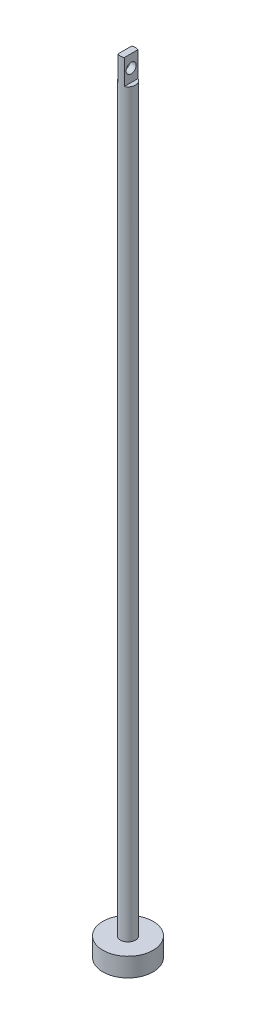
ISO-10303-21;
HEADER;
FILE_DESCRIPTION(('STEP AP214'),'2;1');
FILE_NAME('part.step','',(''),(''),'','','');
FILE_SCHEMA(('AUTOMOTIVE_DESIGN { 1 0 10303 214 1 1 1 1 }'));
ENDSEC;
DATA;
#1=APPLICATION_CONTEXT('core data for automotive mechanical design processes');
#2=APPLICATION_PROTOCOL_DEFINITION('international standard','automotive_design',2000,#1);
#3=PRODUCT_CONTEXT('',#1,'mechanical');
#4=PRODUCT('Part','Part','',(#3));
#5=PRODUCT_RELATED_PRODUCT_CATEGORY('part','',(#4));
#6=PRODUCT_DEFINITION_FORMATION('','',#4);
#7=PRODUCT_DEFINITION_CONTEXT('part definition',#1,'design');
#8=PRODUCT_DEFINITION('design','',#6,#7);
#9=PRODUCT_DEFINITION_SHAPE('','',#8);
#10=(LENGTH_UNIT() NAMED_UNIT(*) SI_UNIT(.MILLI.,.METRE.));
#11=(NAMED_UNIT(*) PLANE_ANGLE_UNIT() SI_UNIT($,.RADIAN.));
#12=(NAMED_UNIT(*) SI_UNIT($,.STERADIAN.) SOLID_ANGLE_UNIT());
#13=UNCERTAINTY_MEASURE_WITH_UNIT(LENGTH_MEASURE(1.E-05),#10,'distance_accuracy_value','');
#14=(GEOMETRIC_REPRESENTATION_CONTEXT(3) GLOBAL_UNCERTAINTY_ASSIGNED_CONTEXT((#13)) GLOBAL_UNIT_ASSIGNED_CONTEXT((#10,
#11,#12)) REPRESENTATION_CONTEXT('',''));
#15=CARTESIAN_POINT('',(0.,0.,0.));
#16=DIRECTION('',(0.,0.,1.));
#17=DIRECTION('',(1.,0.,0.));
#18=AXIS2_PLACEMENT_3D('',#15,#16,#17);
#19=CARTESIAN_POINT('',(0.,625.,0.));
#20=DIRECTION('',(0.,-1.,0.));
#21=DIRECTION('',(0.,0.,-1.));
#22=AXIS2_PLACEMENT_3D('',#19,#20,#21);
#23=CYLINDRICAL_SURFACE('',#22,6.);
#24=CARTESIAN_POINT('',(0.,15.,0.));
#25=DIRECTION('',(0.,1.,0.));
#26=DIRECTION('',(0.,0.,1.));
#27=AXIS2_PLACEMENT_3D('',#24,#25,#26);
#28=CIRCLE('',#27,6.);
#29=CARTESIAN_POINT('',(0.,15.,6.));
#30=VERTEX_POINT('',#29);
#31=EDGE_CURVE('E100',#30,#30,#28,.T.);
#32=ORIENTED_EDGE('',*,*,#31,.T.);
#33=EDGE_LOOP('',(#32));
#34=FACE_BOUND('',#33,.T.);
#35=DIRECTION('',(0.,-1.,0.));
#36=VECTOR('',#35,1.);
#37=CARTESIAN_POINT('',(2.5,625.,5.45435605731786));
#38=LINE('',#37,#36);
#39=CARTESIAN_POINT('',(2.5,625.,5.45435605731786));
#40=VERTEX_POINT('',#39);
#41=CARTESIAN_POINT('',(2.5,605.,5.45435605731786));
#42=VERTEX_POINT('',#41);
#43=EDGE_CURVE('E103',#40,#42,#38,.T.);
#44=ORIENTED_EDGE('',*,*,#43,.F.);
#45=CARTESIAN_POINT('',(0.,625.,0.));
#46=DIRECTION('',(0.,1.,0.));
#47=DIRECTION('',(0.,0.,1.));
#48=AXIS2_PLACEMENT_3D('',#45,#46,#47);
#49=CIRCLE('',#48,6.);
#50=CARTESIAN_POINT('',(-2.5,625.,5.45435605731786));
#51=VERTEX_POINT('',#50);
#52=EDGE_CURVE('E96',#51,#40,#49,.T.);
#53=ORIENTED_EDGE('',*,*,#52,.F.);
#54=DIRECTION('',(0.,-1.,0.));
#55=VECTOR('',#54,1.);
#56=CARTESIAN_POINT('',(-2.5,625.,5.45435605731786));
#57=LINE('',#56,#55);
#58=CARTESIAN_POINT('',(-2.5,605.,5.45435605731786));
#59=VERTEX_POINT('',#58);
#60=EDGE_CURVE('E52',#59,#51,#57,.F.);
#61=ORIENTED_EDGE('',*,*,#60,.F.);
#62=CARTESIAN_POINT('',(0.,605.,0.));
#63=DIRECTION('',(0.,1.,0.));
#64=DIRECTION('',(0.,0.,1.));
#65=AXIS2_PLACEMENT_3D('',#62,#63,#64);
#66=CIRCLE('',#65,6.);
#67=CARTESIAN_POINT('',(-2.5,605.,-5.45435605731786));
#68=VERTEX_POINT('',#67);
#69=EDGE_CURVE('E45',#68,#59,#66,.T.);
#70=ORIENTED_EDGE('',*,*,#69,.F.);
#71=DIRECTION('',(0.,-1.,0.));
#72=VECTOR('',#71,1.);
#73=CARTESIAN_POINT('',(-2.5,625.,-5.45435605731786));
#74=LINE('',#73,#72);
#75=CARTESIAN_POINT('',(-2.5,625.,-5.45435605731786));
#76=VERTEX_POINT('',#75);
#77=EDGE_CURVE('E79',#76,#68,#74,.T.);
#78=ORIENTED_EDGE('',*,*,#77,.F.);
#79=CARTESIAN_POINT('',(2.5,625.,-5.45435605731786));
#80=VERTEX_POINT('',#79);
#81=EDGE_CURVE('E92',#80,#76,#49,.T.);
#82=ORIENTED_EDGE('',*,*,#81,.F.);
#83=DIRECTION('',(0.,-1.,0.));
#84=VECTOR('',#83,1.);
#85=CARTESIAN_POINT('',(2.5,625.,-5.45435605731786));
#86=LINE('',#85,#84);
#87=CARTESIAN_POINT('',(2.5,605.,-5.45435605731786));
#88=VERTEX_POINT('',#87);
#89=EDGE_CURVE('E60',#88,#80,#86,.F.);
#90=ORIENTED_EDGE('',*,*,#89,.F.);
#91=EDGE_CURVE('E12',#42,#88,#66,.T.);
#92=ORIENTED_EDGE('',*,*,#91,.F.);
#93=EDGE_LOOP('',(#44,#53,#61,#70,#78,#82,#90,#92));
#94=FACE_BOUND('',#93,.T.);
#95=ADVANCED_FACE('F36',(#34,#94),#23,.T.);
#96=CARTESIAN_POINT('',(0.,625.,0.));
#97=DIRECTION('',(0.,1.,0.));
#98=DIRECTION('',(0.,0.,1.));
#99=AXIS2_PLACEMENT_3D('',#96,#97,#98);
#100=PLANE('',#99);
#101=ORIENTED_EDGE('',*,*,#52,.T.);
#102=DIRECTION('',(0.,0.,-1.));
#103=VECTOR('',#102,1.);
#104=CARTESIAN_POINT('',(2.5,625.,0.));
#105=LINE('',#104,#103);
#106=EDGE_CURVE('E85',#40,#80,#105,.T.);
#107=ORIENTED_EDGE('',*,*,#106,.T.);
#108=ORIENTED_EDGE('',*,*,#81,.T.);
#109=DIRECTION('',(0.,0.,1.));
#110=VECTOR('',#109,1.);
#111=CARTESIAN_POINT('',(-2.5,625.,0.));
#112=LINE('',#111,#110);
#113=EDGE_CURVE('E76',#76,#51,#112,.T.);
#114=ORIENTED_EDGE('',*,*,#113,.T.);
#115=EDGE_LOOP('',(#101,#107,#108,#114));
#116=FACE_BOUND('',#115,.T.);
#117=ADVANCED_FACE('F94',(#116),#100,.T.);
#118=CARTESIAN_POINT('',(0.,15.,0.));
#119=DIRECTION('',(0.,-1.,0.));
#120=DIRECTION('',(0.,0.,-1.));
#121=AXIS2_PLACEMENT_3D('',#118,#119,#120);
#122=CYLINDRICAL_SURFACE('',#121,20.);
#123=CARTESIAN_POINT('',(0.,15.,0.));
#124=DIRECTION('',(0.,1.,0.));
#125=DIRECTION('',(0.,0.,1.));
#126=AXIS2_PLACEMENT_3D('',#123,#124,#125);
#127=CIRCLE('',#126,20.);
#128=CARTESIAN_POINT('',(0.,15.,20.));
#129=VERTEX_POINT('',#128);
#130=EDGE_CURVE('E86',#129,#129,#127,.T.);
#131=ORIENTED_EDGE('',*,*,#130,.F.);
#132=EDGE_LOOP('',(#131));
#133=FACE_BOUND('',#132,.T.);
#134=CARTESIAN_POINT('',(0.,0.,0.));
#135=DIRECTION('',(0.,1.,0.));
#136=DIRECTION('',(0.,0.,1.));
#137=AXIS2_PLACEMENT_3D('',#134,#135,#136);
#138=CIRCLE('',#137,20.);
#139=CARTESIAN_POINT('',(0.,0.,20.));
#140=VERTEX_POINT('',#139);
#141=EDGE_CURVE('E95',#140,#140,#138,.T.);
#142=ORIENTED_EDGE('',*,*,#141,.T.);
#143=EDGE_LOOP('',(#142));
#144=FACE_BOUND('',#143,.T.);
#145=ADVANCED_FACE('F38',(#133,#144),#122,.T.);
#146=CARTESIAN_POINT('',(0.,15.,0.));
#147=DIRECTION('',(0.,1.,0.));
#148=DIRECTION('',(0.,0.,1.));
#149=AXIS2_PLACEMENT_3D('',#146,#147,#148);
#150=PLANE('',#149);
#151=ORIENTED_EDGE('',*,*,#31,.F.);
#152=EDGE_LOOP('',(#151));
#153=FACE_BOUND('',#152,.T.);
#154=ORIENTED_EDGE('',*,*,#130,.T.);
#155=EDGE_LOOP('',(#154));
#156=FACE_BOUND('',#155,.T.);
#157=ADVANCED_FACE('F137',(#153,#156),#150,.T.);
#158=CARTESIAN_POINT('',(0.,0.,0.));
#159=DIRECTION('',(0.,1.,0.));
#160=DIRECTION('',(0.,0.,1.));
#161=AXIS2_PLACEMENT_3D('',#158,#159,#160);
#162=PLANE('',#161);
#163=ORIENTED_EDGE('',*,*,#141,.F.);
#164=EDGE_LOOP('',(#163));
#165=FACE_BOUND('',#164,.T.);
#166=ADVANCED_FACE('F130',(#165),#162,.F.);
#167=CARTESIAN_POINT('',(-2.5,605.,-10.));
#168=DIRECTION('',(-1.,0.,0.));
#169=DIRECTION('',(0.,0.,1.));
#170=AXIS2_PLACEMENT_3D('',#167,#168,#169);
#171=PLANE('',#170);
#172=CARTESIAN_POINT('',(-2.5,615.000000000005,0.));
#173=DIRECTION('',(-1.,0.,0.));
#174=DIRECTION('',(0.,0.,1.));
#175=AXIS2_PLACEMENT_3D('',#172,#173,#174);
#176=CIRCLE('',#175,4.00000000000001);
#177=CARTESIAN_POINT('',(-2.5,615.000000000005,4.00000000000001));
#178=VERTEX_POINT('',#177);
#179=EDGE_CURVE('E122',#178,#178,#176,.T.);
#180=ORIENTED_EDGE('',*,*,#179,.F.);
#181=EDGE_LOOP('',(#180));
#182=FACE_BOUND('',#181,.T.);
#183=ORIENTED_EDGE('',*,*,#77,.T.);
#184=DIRECTION('',(0.,0.,1.));
#185=VECTOR('',#184,1.);
#186=CARTESIAN_POINT('',(-2.5,605.,-10.));
#187=LINE('',#186,#185);
#188=EDGE_CURVE('E111',#68,#59,#187,.T.);
#189=ORIENTED_EDGE('',*,*,#188,.T.);
#190=ORIENTED_EDGE('',*,*,#60,.T.);
#191=ORIENTED_EDGE('',*,*,#113,.F.);
#192=EDGE_LOOP('',(#183,#189,#190,#191));
#193=FACE_BOUND('',#192,.T.);
#194=ADVANCED_FACE('F78',(#182,#193),#171,.T.);
#195=CARTESIAN_POINT('',(0.,605.,0.));
#196=DIRECTION('',(0.,1.,0.));
#197=DIRECTION('',(0.,0.,1.));
#198=AXIS2_PLACEMENT_3D('',#195,#196,#197);
#199=PLANE('',#198);
#200=ORIENTED_EDGE('',*,*,#69,.T.);
#201=ORIENTED_EDGE('',*,*,#188,.F.);
#202=EDGE_LOOP('',(#200,#201));
#203=FACE_BOUND('',#202,.T.);
#204=ADVANCED_FACE('F110',(#203),#199,.T.);
#205=ORIENTED_EDGE('',*,*,#91,.T.);
#206=DIRECTION('',(0.,0.,-1.));
#207=VECTOR('',#206,1.);
#208=CARTESIAN_POINT('',(2.5,605.,-10.));
#209=LINE('',#208,#207);
#210=EDGE_CURVE('E112',#42,#88,#209,.T.);
#211=ORIENTED_EDGE('',*,*,#210,.F.);
#212=EDGE_LOOP('',(#205,#211));
#213=FACE_BOUND('',#212,.T.);
#214=ADVANCED_FACE('F120',(#213),#199,.T.);
#215=CARTESIAN_POINT('',(2.5,605.,-10.));
#216=DIRECTION('',(1.,0.,0.));
#217=DIRECTION('',(0.,0.,-1.));
#218=AXIS2_PLACEMENT_3D('',#215,#216,#217);
#219=PLANE('',#218);
#220=CARTESIAN_POINT('',(2.5,615.000000000005,0.));
#221=DIRECTION('',(1.,0.,0.));
#222=DIRECTION('',(0.,0.,-1.));
#223=AXIS2_PLACEMENT_3D('',#220,#221,#222);
#224=CIRCLE('',#223,4.00000000000001);
#225=CARTESIAN_POINT('',(2.5,615.000000000005,-4.00000000000001));
#226=VERTEX_POINT('',#225);
#227=EDGE_CURVE('E40',#226,#226,#224,.T.);
#228=ORIENTED_EDGE('',*,*,#227,.F.);
#229=EDGE_LOOP('',(#228));
#230=FACE_BOUND('',#229,.T.);
#231=ORIENTED_EDGE('',*,*,#43,.T.);
#232=ORIENTED_EDGE('',*,*,#210,.T.);
#233=ORIENTED_EDGE('',*,*,#89,.T.);
#234=ORIENTED_EDGE('',*,*,#106,.F.);
#235=EDGE_LOOP('',(#231,#232,#233,#234));
#236=FACE_BOUND('',#235,.T.);
#237=ADVANCED_FACE('F117',(#230,#236),#219,.T.);
#238=CARTESIAN_POINT('',(17.5,615.000000000005,0.));
#239=DIRECTION('',(-1.,0.,0.));
#240=DIRECTION('',(0.,0.,1.));
#241=AXIS2_PLACEMENT_3D('',#238,#239,#240);
#242=CYLINDRICAL_SURFACE('',#241,4.00000000000001);
#243=ORIENTED_EDGE('',*,*,#227,.T.);
#244=EDGE_LOOP('',(#243));
#245=FACE_BOUND('',#244,.T.);
#246=ORIENTED_EDGE('',*,*,#179,.T.);
#247=EDGE_LOOP('',(#246));
#248=FACE_BOUND('',#247,.T.);
#249=ADVANCED_FACE('F127',(#245,#248),#242,.F.);
#250=CLOSED_SHELL('',(#95,#117,#145,#157,#166,#194,#204,#214,#237,#249));
#251=MANIFOLD_SOLID_BREP('B2',#250);
#252=ADVANCED_BREP_SHAPE_REPRESENTATION('',(#18,#251),#14);
#253=SHAPE_DEFINITION_REPRESENTATION(#9,#252);
ENDSEC;
END-ISO-10303-21;
